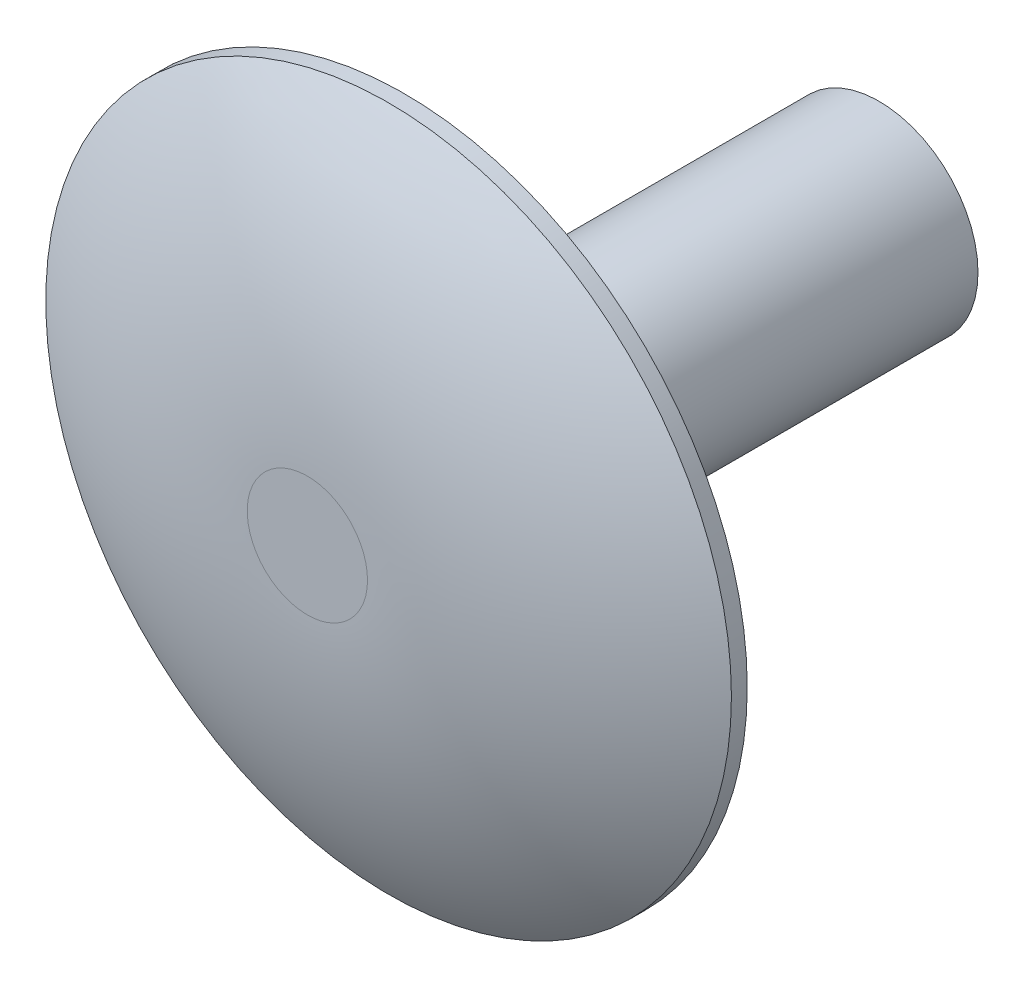
ISO-10303-21;
HEADER;
FILE_DESCRIPTION(('STEP AP214'),'2;1');
FILE_NAME('part.step','',(''),(''),'','','');
FILE_SCHEMA(('AUTOMOTIVE_DESIGN { 1 0 10303 214 1 1 1 1 }'));
ENDSEC;
DATA;
#1=APPLICATION_CONTEXT('core data for automotive mechanical design processes');
#2=APPLICATION_PROTOCOL_DEFINITION('international standard','automotive_design',2000,#1);
#3=PRODUCT_CONTEXT('',#1,'mechanical');
#4=PRODUCT('Part','Part','',(#3));
#5=PRODUCT_RELATED_PRODUCT_CATEGORY('part','',(#4));
#6=PRODUCT_DEFINITION_FORMATION('','',#4);
#7=PRODUCT_DEFINITION_CONTEXT('part definition',#1,'design');
#8=PRODUCT_DEFINITION('design','',#6,#7);
#9=PRODUCT_DEFINITION_SHAPE('','',#8);
#10=(LENGTH_UNIT() NAMED_UNIT(*) SI_UNIT(.MILLI.,.METRE.));
#11=(NAMED_UNIT(*) PLANE_ANGLE_UNIT() SI_UNIT($,.RADIAN.));
#12=(NAMED_UNIT(*) SI_UNIT($,.STERADIAN.) SOLID_ANGLE_UNIT());
#13=UNCERTAINTY_MEASURE_WITH_UNIT(LENGTH_MEASURE(1.E-05),#10,'distance_accuracy_value','');
#14=(GEOMETRIC_REPRESENTATION_CONTEXT(3) GLOBAL_UNCERTAINTY_ASSIGNED_CONTEXT((#13)) GLOBAL_UNIT_ASSIGNED_CONTEXT((#10,
#11,#12)) REPRESENTATION_CONTEXT('',''));
#15=CARTESIAN_POINT('',(0.,0.,0.));
#16=DIRECTION('',(0.,0.,1.));
#17=DIRECTION('',(1.,0.,0.));
#18=AXIS2_PLACEMENT_3D('',#15,#16,#17);
#19=CARTESIAN_POINT('',(0.,0.,2.3368));
#20=DIRECTION('',(0.,0.,-1.));
#21=DIRECTION('',(-1.,0.,0.));
#22=AXIS2_PLACEMENT_3D('',#19,#20,#21);
#23=CYLINDRICAL_SURFACE('',#22,8.255);
#24=CARTESIAN_POINT('',(0.,0.,0.));
#25=DIRECTION('',(0.,0.,1.));
#26=DIRECTION('',(1.,0.,0.));
#27=AXIS2_PLACEMENT_3D('',#24,#25,#26);
#28=CIRCLE('',#27,8.255);
#29=CARTESIAN_POINT('',(8.255,0.,0.));
#30=VERTEX_POINT('',#29);
#31=EDGE_CURVE('E10',#30,#30,#28,.T.);
#32=ORIENTED_EDGE('',*,*,#31,.T.);
#33=EDGE_LOOP('',(#32));
#34=FACE_BOUND('',#33,.T.);
#35=CARTESIAN_POINT('',(0.,0.,0.381));
#36=DIRECTION('',(0.,0.,1.));
#37=DIRECTION('',(1.,0.,0.));
#38=AXIS2_PLACEMENT_3D('',#35,#36,#37);
#39=CIRCLE('',#38,8.255);
#40=CARTESIAN_POINT('',(8.255,0.,0.381));
#41=VERTEX_POINT('',#40);
#42=EDGE_CURVE('E54',#41,#41,#39,.T.);
#43=ORIENTED_EDGE('',*,*,#42,.F.);
#44=EDGE_LOOP('',(#43));
#45=FACE_BOUND('',#44,.T.);
#46=ADVANCED_FACE('F35',(#34,#45),#23,.T.);
#47=CARTESIAN_POINT('',(0.,0.,0.));
#48=DIRECTION('',(0.,0.,1.));
#49=DIRECTION('',(1.,0.,0.));
#50=AXIS2_PLACEMENT_3D('',#47,#48,#49);
#51=PLANE('',#50);
#52=CARTESIAN_POINT('',(0.,0.,0.));
#53=DIRECTION('',(0.,0.,1.));
#54=DIRECTION('',(1.,0.,0.));
#55=AXIS2_PLACEMENT_3D('',#52,#53,#54);
#56=CIRCLE('',#55,2.38125);
#57=CARTESIAN_POINT('',(2.38125,0.,0.));
#58=VERTEX_POINT('',#57);
#59=EDGE_CURVE('E45',#58,#58,#56,.T.);
#60=ORIENTED_EDGE('',*,*,#59,.T.);
#61=EDGE_LOOP('',(#60));
#62=FACE_BOUND('',#61,.T.);
#63=ORIENTED_EDGE('',*,*,#31,.F.);
#64=EDGE_LOOP('',(#63));
#65=FACE_BOUND('',#64,.T.);
#66=ADVANCED_FACE('F62',(#62,#65),#51,.F.);
#67=CARTESIAN_POINT('',(0.,0.,-11.43));
#68=DIRECTION('',(0.,0.,1.));
#69=DIRECTION('',(1.,0.,0.));
#70=AXIS2_PLACEMENT_3D('',#67,#68,#69);
#71=CYLINDRICAL_SURFACE('',#70,2.38125);
#72=CARTESIAN_POINT('',(0.,0.,-11.43));
#73=DIRECTION('',(0.,0.,1.));
#74=DIRECTION('',(1.,0.,0.));
#75=AXIS2_PLACEMENT_3D('',#72,#73,#74);
#76=CIRCLE('',#75,2.38125);
#77=CARTESIAN_POINT('',(2.38125,0.,-11.43));
#78=VERTEX_POINT('',#77);
#79=EDGE_CURVE('E41',#78,#78,#76,.T.);
#80=ORIENTED_EDGE('',*,*,#79,.T.);
#81=EDGE_LOOP('',(#80));
#82=FACE_BOUND('',#81,.T.);
#83=ORIENTED_EDGE('',*,*,#59,.F.);
#84=EDGE_LOOP('',(#83));
#85=FACE_BOUND('',#84,.T.);
#86=ADVANCED_FACE('F68',(#82,#85),#71,.T.);
#87=CARTESIAN_POINT('',(0.,0.,-11.43));
#88=DIRECTION('',(0.,0.,1.));
#89=DIRECTION('',(1.,0.,0.));
#90=AXIS2_PLACEMENT_3D('',#87,#88,#89);
#91=PLANE('',#90);
#92=ORIENTED_EDGE('',*,*,#79,.F.);
#93=EDGE_LOOP('',(#92));
#94=FACE_BOUND('',#93,.T.);
#95=ADVANCED_FACE('F73',(#94),#91,.F.);
#96=CARTESIAN_POINT('',(0.,0.,-10.4873961038961));
#97=DIRECTION('',(0.,0.,1.));
#98=DIRECTION('',(1.,0.,0.));
#99=AXIS2_PLACEMENT_3D('',#96,#97,#98);
#100=DEGENERATE_TOROIDAL_SURFACE('',#99,1.4478,12.8241961038961,.T.);
#101=ORIENTED_EDGE('',*,*,#42,.T.);
#102=EDGE_LOOP('',(#101));
#103=FACE_BOUND('',#102,.T.);
#104=CARTESIAN_POINT('',(0.,0.,2.3368));
#105=DIRECTION('',(0.,0.,1.));
#106=DIRECTION('',(1.,0.,0.));
#107=AXIS2_PLACEMENT_3D('',#104,#105,#106);
#108=CIRCLE('',#107,1.4478);
#109=CARTESIAN_POINT('',(1.4478,0.,2.3368));
#110=VERTEX_POINT('',#109);
#111=EDGE_CURVE('E50',#110,#110,#108,.T.);
#112=ORIENTED_EDGE('',*,*,#111,.F.);
#113=EDGE_LOOP('',(#112));
#114=FACE_BOUND('',#113,.T.);
#115=ADVANCED_FACE('F58',(#103,#114),#100,.T.);
#116=CARTESIAN_POINT('',(0.,0.,2.3368));
#117=DIRECTION('',(0.,0.,1.));
#118=DIRECTION('',(1.,0.,0.));
#119=AXIS2_PLACEMENT_3D('',#116,#117,#118);
#120=PLANE('',#119);
#121=ORIENTED_EDGE('',*,*,#111,.T.);
#122=EDGE_LOOP('',(#121));
#123=FACE_BOUND('',#122,.T.);
#124=ADVANCED_FACE('F77',(#123),#120,.T.);
#125=CLOSED_SHELL('',(#46,#66,#86,#95,#115,#124));
#126=MANIFOLD_SOLID_BREP('B2',#125);
#127=ADVANCED_BREP_SHAPE_REPRESENTATION('',(#18,#126),#14);
#128=SHAPE_DEFINITION_REPRESENTATION(#9,#127);
ENDSEC;
END-ISO-10303-21;
